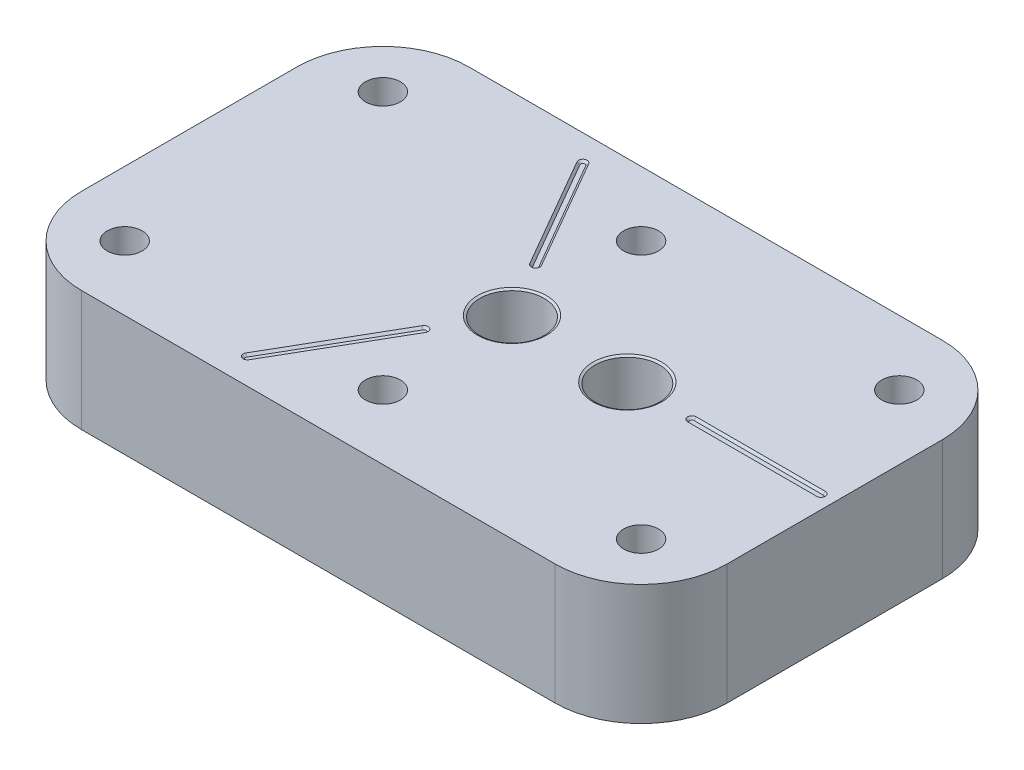
ISO-10303-21;
HEADER;
FILE_DESCRIPTION(('STEP AP214'),'2;1');
FILE_NAME('part.step','',(''),(''),'','','');
FILE_SCHEMA(('AUTOMOTIVE_DESIGN { 1 0 10303 214 1 1 1 1 }'));
ENDSEC;
DATA;
#1=APPLICATION_CONTEXT('core data for automotive mechanical design processes');
#2=APPLICATION_PROTOCOL_DEFINITION('international standard','automotive_design',2000,#1);
#3=PRODUCT_CONTEXT('',#1,'mechanical');
#4=PRODUCT('Part','Part','',(#3));
#5=PRODUCT_RELATED_PRODUCT_CATEGORY('part','',(#4));
#6=PRODUCT_DEFINITION_FORMATION('','',#4);
#7=PRODUCT_DEFINITION_CONTEXT('part definition',#1,'design');
#8=PRODUCT_DEFINITION('design','',#6,#7);
#9=PRODUCT_DEFINITION_SHAPE('','',#8);
#10=(LENGTH_UNIT() NAMED_UNIT(*) SI_UNIT(.MILLI.,.METRE.));
#11=(NAMED_UNIT(*) PLANE_ANGLE_UNIT() SI_UNIT($,.RADIAN.));
#12=(NAMED_UNIT(*) SI_UNIT($,.STERADIAN.) SOLID_ANGLE_UNIT());
#13=UNCERTAINTY_MEASURE_WITH_UNIT(LENGTH_MEASURE(1.E-05),#10,'distance_accuracy_value','');
#14=(GEOMETRIC_REPRESENTATION_CONTEXT(3) GLOBAL_UNCERTAINTY_ASSIGNED_CONTEXT((#13)) GLOBAL_UNIT_ASSIGNED_CONTEXT((#10,
#11,#12)) REPRESENTATION_CONTEXT('',''));
#15=CARTESIAN_POINT('',(0.,0.,0.));
#16=DIRECTION('',(0.,0.,1.));
#17=DIRECTION('',(1.,0.,0.));
#18=AXIS2_PLACEMENT_3D('',#15,#16,#17);
#19=CARTESIAN_POINT('',(95.25,35.56,-57.15));
#20=DIRECTION('',(-1.,0.,0.));
#21=DIRECTION('',(0.,0.,1.));
#22=AXIS2_PLACEMENT_3D('',#19,#20,#21);
#23=PLANE('',#22);
#24=DIRECTION('',(0.,0.,-1.));
#25=VECTOR('',#24,1.);
#26=CARTESIAN_POINT('',(95.25,0.,-57.15));
#27=LINE('',#26,#25);
#28=CARTESIAN_POINT('',(95.25,0.,31.75));
#29=VERTEX_POINT('',#28);
#30=CARTESIAN_POINT('',(95.25,0.,-31.75));
#31=VERTEX_POINT('',#30);
#32=EDGE_CURVE('E285',#29,#31,#27,.T.);
#33=ORIENTED_EDGE('',*,*,#32,.T.);
#34=DIRECTION('',(0.,-1.,0.));
#35=VECTOR('',#34,1.);
#36=CARTESIAN_POINT('',(95.25,35.56,-31.75));
#37=LINE('',#36,#35);
#38=CARTESIAN_POINT('',(95.25,35.56,-31.75));
#39=VERTEX_POINT('',#38);
#40=EDGE_CURVE('E349',#31,#39,#37,.F.);
#41=ORIENTED_EDGE('',*,*,#40,.T.);
#42=DIRECTION('',(0.,0.,-1.));
#43=VECTOR('',#42,1.);
#44=CARTESIAN_POINT('',(95.25,35.56,-57.15));
#45=LINE('',#44,#43);
#46=CARTESIAN_POINT('',(95.25,35.56,31.75));
#47=VERTEX_POINT('',#46);
#48=EDGE_CURVE('E286',#47,#39,#45,.T.);
#49=ORIENTED_EDGE('',*,*,#48,.F.);
#50=DIRECTION('',(0.,-1.,0.));
#51=VECTOR('',#50,1.);
#52=CARTESIAN_POINT('',(95.25,35.56,31.75));
#53=LINE('',#52,#51);
#54=EDGE_CURVE('E346',#47,#29,#53,.T.);
#55=ORIENTED_EDGE('',*,*,#54,.T.);
#56=EDGE_LOOP('',(#33,#41,#49,#55));
#57=FACE_BOUND('',#56,.T.);
#58=ADVANCED_FACE('F33',(#57),#23,.F.);
#59=CARTESIAN_POINT('',(-95.25,35.56,-57.15));
#60=DIRECTION('',(0.,0.,1.));
#61=DIRECTION('',(1.,0.,0.));
#62=AXIS2_PLACEMENT_3D('',#59,#60,#61);
#63=PLANE('',#62);
#64=DIRECTION('',(-1.,0.,0.));
#65=VECTOR('',#64,1.);
#66=CARTESIAN_POINT('',(-95.25,35.56,-57.15));
#67=LINE('',#66,#65);
#68=CARTESIAN_POINT('',(69.85,35.56,-57.15));
#69=VERTEX_POINT('',#68);
#70=CARTESIAN_POINT('',(-69.85,35.56,-57.15));
#71=VERTEX_POINT('',#70);
#72=EDGE_CURVE('E289',#69,#71,#67,.T.);
#73=ORIENTED_EDGE('',*,*,#72,.F.);
#74=DIRECTION('',(0.,-1.,0.));
#75=VECTOR('',#74,1.);
#76=CARTESIAN_POINT('',(69.85,35.56,-57.15));
#77=LINE('',#76,#75);
#78=CARTESIAN_POINT('',(69.85,0.,-57.15));
#79=VERTEX_POINT('',#78);
#80=EDGE_CURVE('E335',#69,#79,#77,.T.);
#81=ORIENTED_EDGE('',*,*,#80,.T.);
#82=DIRECTION('',(-1.,0.,0.));
#83=VECTOR('',#82,1.);
#84=CARTESIAN_POINT('',(-95.25,0.,-57.15));
#85=LINE('',#84,#83);
#86=CARTESIAN_POINT('',(-69.85,0.,-57.15));
#87=VERTEX_POINT('',#86);
#88=EDGE_CURVE('E302',#79,#87,#85,.T.);
#89=ORIENTED_EDGE('',*,*,#88,.T.);
#90=DIRECTION('',(0.,-1.,0.));
#91=VECTOR('',#90,1.);
#92=CARTESIAN_POINT('',(-69.85,35.56,-57.15));
#93=LINE('',#92,#91);
#94=EDGE_CURVE('E333',#87,#71,#93,.F.);
#95=ORIENTED_EDGE('',*,*,#94,.T.);
#96=EDGE_LOOP('',(#73,#81,#89,#95));
#97=FACE_BOUND('',#96,.T.);
#98=ADVANCED_FACE('F424',(#97),#63,.F.);
#99=CARTESIAN_POINT('',(-95.25,35.56,-57.15));
#100=DIRECTION('',(1.,0.,0.));
#101=DIRECTION('',(0.,0.,-1.));
#102=AXIS2_PLACEMENT_3D('',#99,#100,#101);
#103=PLANE('',#102);
#104=DIRECTION('',(0.,0.,1.));
#105=VECTOR('',#104,1.);
#106=CARTESIAN_POINT('',(-95.25,0.,-57.15));
#107=LINE('',#106,#105);
#108=CARTESIAN_POINT('',(-95.25,0.,-31.75));
#109=VERTEX_POINT('',#108);
#110=CARTESIAN_POINT('',(-95.25,0.,31.75));
#111=VERTEX_POINT('',#110);
#112=EDGE_CURVE('E305',#109,#111,#107,.T.);
#113=ORIENTED_EDGE('',*,*,#112,.T.);
#114=DIRECTION('',(0.,-1.,0.));
#115=VECTOR('',#114,1.);
#116=CARTESIAN_POINT('',(-95.25,35.56,31.75));
#117=LINE('',#116,#115);
#118=CARTESIAN_POINT('',(-95.25,35.56,31.75));
#119=VERTEX_POINT('',#118);
#120=EDGE_CURVE('E11',#111,#119,#117,.F.);
#121=ORIENTED_EDGE('',*,*,#120,.T.);
#122=DIRECTION('',(0.,0.,1.));
#123=VECTOR('',#122,1.);
#124=CARTESIAN_POINT('',(-95.25,35.56,-57.15));
#125=LINE('',#124,#123);
#126=CARTESIAN_POINT('',(-95.25,35.56,-31.75));
#127=VERTEX_POINT('',#126);
#128=EDGE_CURVE('E293',#127,#119,#125,.T.);
#129=ORIENTED_EDGE('',*,*,#128,.F.);
#130=DIRECTION('',(0.,-1.,0.));
#131=VECTOR('',#130,1.);
#132=CARTESIAN_POINT('',(-95.25,35.56,-31.75));
#133=LINE('',#132,#131);
#134=EDGE_CURVE('E42',#127,#109,#133,.T.);
#135=ORIENTED_EDGE('',*,*,#134,.T.);
#136=EDGE_LOOP('',(#113,#121,#129,#135));
#137=FACE_BOUND('',#136,.T.);
#138=ADVANCED_FACE('F430',(#137),#103,.F.);
#139=CARTESIAN_POINT('',(-95.25,35.56,57.15));
#140=DIRECTION('',(0.,0.,-1.));
#141=DIRECTION('',(-1.,0.,0.));
#142=AXIS2_PLACEMENT_3D('',#139,#140,#141);
#143=PLANE('',#142);
#144=DIRECTION('',(1.,0.,0.));
#145=VECTOR('',#144,1.);
#146=CARTESIAN_POINT('',(-95.25,0.,57.15));
#147=LINE('',#146,#145);
#148=CARTESIAN_POINT('',(-69.85,0.,57.15));
#149=VERTEX_POINT('',#148);
#150=CARTESIAN_POINT('',(69.85,0.,57.15));
#151=VERTEX_POINT('',#150);
#152=EDGE_CURVE('E290',#149,#151,#147,.T.);
#153=ORIENTED_EDGE('',*,*,#152,.T.);
#154=DIRECTION('',(0.,-1.,0.));
#155=VECTOR('',#154,1.);
#156=CARTESIAN_POINT('',(69.85,35.56,57.15));
#157=LINE('',#156,#155);
#158=CARTESIAN_POINT('',(69.85,35.56,57.15));
#159=VERTEX_POINT('',#158);
#160=EDGE_CURVE('E362',#151,#159,#157,.F.);
#161=ORIENTED_EDGE('',*,*,#160,.T.);
#162=DIRECTION('',(1.,0.,0.));
#163=VECTOR('',#162,1.);
#164=CARTESIAN_POINT('',(-95.25,35.56,57.15));
#165=LINE('',#164,#163);
#166=CARTESIAN_POINT('',(-69.85,35.56,57.15));
#167=VERTEX_POINT('',#166);
#168=EDGE_CURVE('E296',#167,#159,#165,.T.);
#169=ORIENTED_EDGE('',*,*,#168,.F.);
#170=DIRECTION('',(0.,-1.,0.));
#171=VECTOR('',#170,1.);
#172=CARTESIAN_POINT('',(-69.85,35.56,57.15));
#173=LINE('',#172,#171);
#174=EDGE_CURVE('E359',#167,#149,#173,.T.);
#175=ORIENTED_EDGE('',*,*,#174,.T.);
#176=EDGE_LOOP('',(#153,#161,#169,#175));
#177=FACE_BOUND('',#176,.T.);
#178=ADVANCED_FACE('F402',(#177),#143,.F.);
#179=CARTESIAN_POINT('',(95.25,35.56,57.15));
#180=DIRECTION('',(0.,1.,0.));
#181=DIRECTION('',(0.,0.,1.));
#182=AXIS2_PLACEMENT_3D('',#179,#180,#181);
#183=PLANE('',#182);
#184=CARTESIAN_POINT('',(0.,35.56,0.));
#185=DIRECTION('',(0.,1.,0.));
#186=DIRECTION('',(0.,0.,1.));
#187=AXIS2_PLACEMENT_3D('',#184,#185,#186);
#188=CIRCLE('',#187,10.16);
#189=CARTESIAN_POINT('',(0.,35.56,10.16));
#190=VERTEX_POINT('',#189);
#191=EDGE_CURVE('E393',#190,#190,#188,.T.);
#192=ORIENTED_EDGE('',*,*,#191,.F.);
#193=EDGE_LOOP('',(#192));
#194=FACE_BOUND('',#193,.T.);
#195=CARTESIAN_POINT('',(34.036,35.56,0.));
#196=DIRECTION('',(0.,1.,0.));
#197=DIRECTION('',(0.,0.,1.));
#198=AXIS2_PLACEMENT_3D('',#195,#196,#197);
#199=CIRCLE('',#198,10.16);
#200=CARTESIAN_POINT('',(34.036,35.56,10.16));
#201=VERTEX_POINT('',#200);
#202=EDGE_CURVE('E381',#201,#201,#199,.T.);
#203=ORIENTED_EDGE('',*,*,#202,.F.);
#204=EDGE_LOOP('',(#203));
#205=FACE_BOUND('',#204,.T.);
#206=CARTESIAN_POINT('',(53.086,35.56,0.));
#207=DIRECTION('',(0.,1.,0.));
#208=DIRECTION('',(0.,0.,-1.));
#209=AXIS2_PLACEMENT_3D('',#206,#207,#208);
#210=CIRCLE('',#209,1.27);
#211=CARTESIAN_POINT('',(53.086,35.56,-1.27));
#212=VERTEX_POINT('',#211);
#213=CARTESIAN_POINT('',(53.086,35.56,1.26999999999999));
#214=VERTEX_POINT('',#213);
#215=EDGE_CURVE('E50',#212,#214,#210,.T.);
#216=ORIENTED_EDGE('',*,*,#215,.F.);
#217=DIRECTION('',(-1.,0.,0.));
#218=VECTOR('',#217,1.);
#219=CARTESIAN_POINT('',(53.086,35.56,-1.27));
#220=LINE('',#219,#218);
#221=CARTESIAN_POINT('',(91.186,35.56,-1.27));
#222=VERTEX_POINT('',#221);
#223=EDGE_CURVE('E193',#222,#212,#220,.T.);
#224=ORIENTED_EDGE('',*,*,#223,.F.);
#225=CARTESIAN_POINT('',(91.186,35.56,0.));
#226=DIRECTION('',(0.,1.,0.));
#227=DIRECTION('',(0.,0.,1.));
#228=AXIS2_PLACEMENT_3D('',#225,#226,#227);
#229=CIRCLE('',#228,1.27);
#230=CARTESIAN_POINT('',(91.186,35.56,1.27));
#231=VERTEX_POINT('',#230);
#232=EDGE_CURVE('E175',#231,#222,#229,.T.);
#233=ORIENTED_EDGE('',*,*,#232,.F.);
#234=DIRECTION('',(1.,0.,0.));
#235=VECTOR('',#234,1.);
#236=CARTESIAN_POINT('',(53.086,35.56,1.27));
#237=LINE('',#236,#235);
#238=EDGE_CURVE('E186',#214,#231,#237,.T.);
#239=ORIENTED_EDGE('',*,*,#238,.F.);
#240=EDGE_LOOP('',(#216,#224,#233,#239));
#241=FACE_BOUND('',#240,.T.);
#242=CARTESIAN_POINT('',(-9.52499999999995,35.56,16.4977839420936));
#243=DIRECTION('',(0.,1.,0.));
#244=DIRECTION('',(0.,0.,-1.));
#245=AXIS2_PLACEMENT_3D('',#242,#243,#244);
#246=CIRCLE('',#245,1.27);
#247=CARTESIAN_POINT('',(-8.42514773719371,35.56,17.1327839420936));
#248=VERTEX_POINT('',#247);
#249=CARTESIAN_POINT('',(-10.6248522628062,35.56,15.8627839420936));
#250=VERTEX_POINT('',#249);
#251=EDGE_CURVE('E58',#248,#250,#246,.T.);
#252=ORIENTED_EDGE('',*,*,#251,.F.);
#253=DIRECTION('',(0.499999999999998,0.,-0.86602540378444));
#254=VECTOR('',#253,1.);
#255=CARTESIAN_POINT('',(-8.42514773719371,35.56,17.1327839420936));
#256=LINE('',#255,#254);
#257=CARTESIAN_POINT('',(-27.4751477371936,35.56,50.1283518262807));
#258=VERTEX_POINT('',#257);
#259=EDGE_CURVE('E218',#258,#248,#256,.T.);
#260=ORIENTED_EDGE('',*,*,#259,.F.);
#261=CARTESIAN_POINT('',(-28.5749999999999,35.56,49.4933518262807));
#262=DIRECTION('',(0.,1.,0.));
#263=DIRECTION('',(0.,0.,1.));
#264=AXIS2_PLACEMENT_3D('',#261,#262,#263);
#265=CIRCLE('',#264,1.27);
#266=CARTESIAN_POINT('',(-29.6748522628061,35.56,48.8583518262807));
#267=VERTEX_POINT('',#266);
#268=EDGE_CURVE('E215',#267,#258,#265,.T.);
#269=ORIENTED_EDGE('',*,*,#268,.F.);
#270=DIRECTION('',(-0.499999999999998,0.,0.86602540378444));
#271=VECTOR('',#270,1.);
#272=CARTESIAN_POINT('',(-10.6248522628062,35.56,15.8627839420936));
#273=LINE('',#272,#271);
#274=EDGE_CURVE('E212',#250,#267,#273,.T.);
#275=ORIENTED_EDGE('',*,*,#274,.F.);
#276=EDGE_LOOP('',(#252,#260,#269,#275));
#277=FACE_BOUND('',#276,.T.);
#278=CARTESIAN_POINT('',(-9.52500000000008,35.56,-16.4977839420935));
#279=DIRECTION('',(0.,1.,0.));
#280=DIRECTION('',(0.,0.,-1.));
#281=AXIS2_PLACEMENT_3D('',#278,#279,#280);
#282=CIRCLE('',#281,1.27);
#283=CARTESIAN_POINT('',(-10.6248522628063,35.56,-15.8627839420935));
#284=VERTEX_POINT('',#283);
#285=CARTESIAN_POINT('',(-8.42514773719385,35.56,-17.1327839420935));
#286=VERTEX_POINT('',#285);
#287=EDGE_CURVE('E224',#284,#286,#282,.T.);
#288=ORIENTED_EDGE('',*,*,#287,.F.);
#289=DIRECTION('',(0.500000000000004,0.,0.866025403784436));
#290=VECTOR('',#289,1.);
#291=CARTESIAN_POINT('',(-10.6248522628063,35.56,-15.8627839420935));
#292=LINE('',#291,#290);
#293=CARTESIAN_POINT('',(-29.6748522628065,35.56,-48.8583518262805));
#294=VERTEX_POINT('',#293);
#295=EDGE_CURVE('E249',#294,#284,#292,.T.);
#296=ORIENTED_EDGE('',*,*,#295,.F.);
#297=CARTESIAN_POINT('',(-28.5750000000002,35.56,-49.4933518262805));
#298=DIRECTION('',(0.,1.,0.));
#299=DIRECTION('',(0.,0.,1.));
#300=AXIS2_PLACEMENT_3D('',#297,#298,#299);
#301=CIRCLE('',#300,1.27);
#302=CARTESIAN_POINT('',(-27.475147737194,35.56,-50.1283518262805));
#303=VERTEX_POINT('',#302);
#304=EDGE_CURVE('E246',#303,#294,#301,.T.);
#305=ORIENTED_EDGE('',*,*,#304,.F.);
#306=DIRECTION('',(-0.500000000000004,0.,-0.866025403784436));
#307=VECTOR('',#306,1.);
#308=CARTESIAN_POINT('',(-8.42514773719385,35.56,-17.1327839420935));
#309=LINE('',#308,#307);
#310=EDGE_CURVE('E243',#286,#303,#309,.T.);
#311=ORIENTED_EDGE('',*,*,#310,.F.);
#312=EDGE_LOOP('',(#288,#296,#305,#311));
#313=FACE_BOUND('',#312,.T.);
#314=CARTESIAN_POINT('',(0.,35.56,-38.1));
#315=DIRECTION('',(0.,1.,0.));
#316=DIRECTION('',(0.,0.,1.));
#317=AXIS2_PLACEMENT_3D('',#314,#315,#316);
#318=CIRCLE('',#317,5.15873999999999);
#319=CARTESIAN_POINT('',(0.,35.56,-32.94126));
#320=VERTEX_POINT('',#319);
#321=EDGE_CURVE('E276',#320,#320,#318,.T.);
#322=ORIENTED_EDGE('',*,*,#321,.F.);
#323=EDGE_LOOP('',(#322));
#324=FACE_BOUND('',#323,.T.);
#325=CARTESIAN_POINT('',(-76.2,35.56,-38.1));
#326=DIRECTION('',(0.,1.,0.));
#327=DIRECTION('',(0.,0.,1.));
#328=AXIS2_PLACEMENT_3D('',#325,#326,#327);
#329=CIRCLE('',#328,5.15873999999999);
#330=CARTESIAN_POINT('',(-76.2,35.56,-32.94126));
#331=VERTEX_POINT('',#330);
#332=EDGE_CURVE('E279',#331,#331,#329,.T.);
#333=ORIENTED_EDGE('',*,*,#332,.F.);
#334=EDGE_LOOP('',(#333));
#335=FACE_BOUND('',#334,.T.);
#336=ORIENTED_EDGE('',*,*,#48,.T.);
#337=CARTESIAN_POINT('',(69.85,35.56,-31.75));
#338=DIRECTION('',(0.,1.,0.));
#339=DIRECTION('',(0.,0.,1.));
#340=AXIS2_PLACEMENT_3D('',#337,#338,#339);
#341=CIRCLE('',#340,25.4);
#342=EDGE_CURVE('E357',#39,#69,#341,.T.);
#343=ORIENTED_EDGE('',*,*,#342,.T.);
#344=ORIENTED_EDGE('',*,*,#72,.T.);
#345=CARTESIAN_POINT('',(-69.85,35.56,-31.75));
#346=DIRECTION('',(0.,1.,0.));
#347=DIRECTION('',(0.,0.,1.));
#348=AXIS2_PLACEMENT_3D('',#345,#346,#347);
#349=CIRCLE('',#348,25.4);
#350=EDGE_CURVE('E351',#71,#127,#349,.T.);
#351=ORIENTED_EDGE('',*,*,#350,.T.);
#352=ORIENTED_EDGE('',*,*,#128,.T.);
#353=CARTESIAN_POINT('',(-69.85,35.56,31.75));
#354=DIRECTION('',(0.,1.,0.));
#355=DIRECTION('',(0.,0.,1.));
#356=AXIS2_PLACEMENT_3D('',#353,#354,#355);
#357=CIRCLE('',#356,25.4);
#358=EDGE_CURVE('E353',#119,#167,#357,.T.);
#359=ORIENTED_EDGE('',*,*,#358,.T.);
#360=ORIENTED_EDGE('',*,*,#168,.T.);
#361=CARTESIAN_POINT('',(69.85,35.56,31.75));
#362=DIRECTION('',(0.,1.,0.));
#363=DIRECTION('',(0.,0.,1.));
#364=AXIS2_PLACEMENT_3D('',#361,#362,#363);
#365=CIRCLE('',#364,25.4);
#366=EDGE_CURVE('E355',#159,#47,#365,.T.);
#367=ORIENTED_EDGE('',*,*,#366,.T.);
#368=EDGE_LOOP('',(#336,#343,#344,#351,#352,#359,#360,#367));
#369=FACE_BOUND('',#368,.T.);
#370=CARTESIAN_POINT('',(76.2,35.56,-38.1));
#371=DIRECTION('',(0.,1.,0.));
#372=DIRECTION('',(0.,0.,1.));
#373=AXIS2_PLACEMENT_3D('',#370,#371,#372);
#374=CIRCLE('',#373,5.15873999999999);
#375=CARTESIAN_POINT('',(76.2,35.56,-32.94126));
#376=VERTEX_POINT('',#375);
#377=EDGE_CURVE('E312',#376,#376,#374,.T.);
#378=ORIENTED_EDGE('',*,*,#377,.F.);
#379=EDGE_LOOP('',(#378));
#380=FACE_BOUND('',#379,.T.);
#381=CARTESIAN_POINT('',(-76.2,35.56,38.1));
#382=DIRECTION('',(0.,1.,0.));
#383=DIRECTION('',(0.,0.,1.));
#384=AXIS2_PLACEMENT_3D('',#381,#382,#383);
#385=CIRCLE('',#384,5.15873999999999);
#386=CARTESIAN_POINT('',(-76.2,35.56,43.25874));
#387=VERTEX_POINT('',#386);
#388=EDGE_CURVE('E318',#387,#387,#385,.T.);
#389=ORIENTED_EDGE('',*,*,#388,.F.);
#390=EDGE_LOOP('',(#389));
#391=FACE_BOUND('',#390,.T.);
#392=CARTESIAN_POINT('',(0.,35.56,38.1));
#393=DIRECTION('',(0.,1.,0.));
#394=DIRECTION('',(0.,0.,1.));
#395=AXIS2_PLACEMENT_3D('',#392,#393,#394);
#396=CIRCLE('',#395,5.15873999999999);
#397=CARTESIAN_POINT('',(0.,35.56,43.25874));
#398=VERTEX_POINT('',#397);
#399=EDGE_CURVE('E324',#398,#398,#396,.T.);
#400=ORIENTED_EDGE('',*,*,#399,.F.);
#401=EDGE_LOOP('',(#400));
#402=FACE_BOUND('',#401,.T.);
#403=CARTESIAN_POINT('',(76.2,35.56,38.1));
#404=DIRECTION('',(0.,1.,0.));
#405=DIRECTION('',(0.,0.,1.));
#406=AXIS2_PLACEMENT_3D('',#403,#404,#405);
#407=CIRCLE('',#406,5.15873999999999);
#408=CARTESIAN_POINT('',(76.2,35.56,43.25874));
#409=VERTEX_POINT('',#408);
#410=EDGE_CURVE('E330',#409,#409,#407,.T.);
#411=ORIENTED_EDGE('',*,*,#410,.F.);
#412=EDGE_LOOP('',(#411));
#413=FACE_BOUND('',#412,.T.);
#414=ADVANCED_FACE('F190',(#194,#205,#241,#277,#313,#324,#335,#369,#380,#391,#402,#413),#183,.T.);
#415=CARTESIAN_POINT('',(95.25,0.,57.15));
#416=DIRECTION('',(0.,1.,0.));
#417=DIRECTION('',(0.,0.,1.));
#418=AXIS2_PLACEMENT_3D('',#415,#416,#417);
#419=PLANE('',#418);
#420=CARTESIAN_POINT('',(0.,0.,0.));
#421=DIRECTION('',(0.,1.,0.));
#422=DIRECTION('',(0.,0.,1.));
#423=AXIS2_PLACEMENT_3D('',#420,#421,#422);
#424=CIRCLE('',#423,8.33373999999999);
#425=CARTESIAN_POINT('',(0.,0.,8.33373999999999));
#426=VERTEX_POINT('',#425);
#427=EDGE_CURVE('E37',#426,#426,#424,.T.);
#428=ORIENTED_EDGE('',*,*,#427,.T.);
#429=EDGE_LOOP('',(#428));
#430=FACE_BOUND('',#429,.T.);
#431=CARTESIAN_POINT('',(34.036,0.,0.));
#432=DIRECTION('',(0.,1.,0.));
#433=DIRECTION('',(0.,0.,1.));
#434=AXIS2_PLACEMENT_3D('',#431,#432,#433);
#435=CIRCLE('',#434,8.33373999999999);
#436=CARTESIAN_POINT('',(34.036,0.,8.33373999999999));
#437=VERTEX_POINT('',#436);
#438=EDGE_CURVE('E365',#437,#437,#435,.T.);
#439=ORIENTED_EDGE('',*,*,#438,.T.);
#440=EDGE_LOOP('',(#439));
#441=FACE_BOUND('',#440,.T.);
#442=CARTESIAN_POINT('',(0.,0.,-38.1));
#443=DIRECTION('',(0.,1.,0.));
#444=DIRECTION('',(0.,0.,1.));
#445=AXIS2_PLACEMENT_3D('',#442,#443,#444);
#446=CIRCLE('',#445,5.15873999999999);
#447=CARTESIAN_POINT('',(0.,0.,-32.94126));
#448=VERTEX_POINT('',#447);
#449=EDGE_CURVE('E255',#448,#448,#446,.T.);
#450=ORIENTED_EDGE('',*,*,#449,.T.);
#451=EDGE_LOOP('',(#450));
#452=FACE_BOUND('',#451,.T.);
#453=CARTESIAN_POINT('',(-76.2,0.,-38.1));
#454=DIRECTION('',(0.,1.,0.));
#455=DIRECTION('',(0.,0.,1.));
#456=AXIS2_PLACEMENT_3D('',#453,#454,#455);
#457=CIRCLE('',#456,5.15873999999999);
#458=CARTESIAN_POINT('',(-76.2,0.,-32.94126));
#459=VERTEX_POINT('',#458);
#460=EDGE_CURVE('E282',#459,#459,#457,.T.);
#461=ORIENTED_EDGE('',*,*,#460,.T.);
#462=EDGE_LOOP('',(#461));
#463=FACE_BOUND('',#462,.T.);
#464=ORIENTED_EDGE('',*,*,#88,.F.);
#465=CARTESIAN_POINT('',(69.85,0.,-31.75));
#466=DIRECTION('',(0.,1.,0.));
#467=DIRECTION('',(0.,0.,1.));
#468=AXIS2_PLACEMENT_3D('',#465,#466,#467);
#469=CIRCLE('',#468,25.4);
#470=EDGE_CURVE('E344',#79,#31,#469,.F.);
#471=ORIENTED_EDGE('',*,*,#470,.T.);
#472=ORIENTED_EDGE('',*,*,#32,.F.);
#473=CARTESIAN_POINT('',(69.85,0.,31.75));
#474=DIRECTION('',(0.,1.,0.));
#475=DIRECTION('',(0.,0.,1.));
#476=AXIS2_PLACEMENT_3D('',#473,#474,#475);
#477=CIRCLE('',#476,25.4);
#478=EDGE_CURVE('E342',#29,#151,#477,.F.);
#479=ORIENTED_EDGE('',*,*,#478,.T.);
#480=ORIENTED_EDGE('',*,*,#152,.F.);
#481=CARTESIAN_POINT('',(-69.85,0.,31.75));
#482=DIRECTION('',(0.,1.,0.));
#483=DIRECTION('',(0.,0.,1.));
#484=AXIS2_PLACEMENT_3D('',#481,#482,#483);
#485=CIRCLE('',#484,25.4);
#486=EDGE_CURVE('E340',#149,#111,#485,.F.);
#487=ORIENTED_EDGE('',*,*,#486,.T.);
#488=ORIENTED_EDGE('',*,*,#112,.F.);
#489=CARTESIAN_POINT('',(-69.85,0.,-31.75));
#490=DIRECTION('',(0.,1.,0.));
#491=DIRECTION('',(0.,0.,1.));
#492=AXIS2_PLACEMENT_3D('',#489,#490,#491);
#493=CIRCLE('',#492,25.4);
#494=EDGE_CURVE('E338',#109,#87,#493,.F.);
#495=ORIENTED_EDGE('',*,*,#494,.T.);
#496=EDGE_LOOP('',(#464,#471,#472,#479,#480,#487,#488,#495));
#497=FACE_BOUND('',#496,.T.);
#498=CARTESIAN_POINT('',(76.2,0.,-38.1));
#499=DIRECTION('',(0.,1.,0.));
#500=DIRECTION('',(0.,0.,1.));
#501=AXIS2_PLACEMENT_3D('',#498,#499,#500);
#502=CIRCLE('',#501,5.15873999999999);
#503=CARTESIAN_POINT('',(76.2,0.,-32.94126));
#504=VERTEX_POINT('',#503);
#505=EDGE_CURVE('E299',#504,#504,#502,.T.);
#506=ORIENTED_EDGE('',*,*,#505,.T.);
#507=EDGE_LOOP('',(#506));
#508=FACE_BOUND('',#507,.T.);
#509=CARTESIAN_POINT('',(-76.2,0.,38.1));
#510=DIRECTION('',(0.,1.,0.));
#511=DIRECTION('',(0.,0.,1.));
#512=AXIS2_PLACEMENT_3D('',#509,#510,#511);
#513=CIRCLE('',#512,5.15873999999999);
#514=CARTESIAN_POINT('',(-76.2,0.,43.25874));
#515=VERTEX_POINT('',#514);
#516=EDGE_CURVE('E315',#515,#515,#513,.T.);
#517=ORIENTED_EDGE('',*,*,#516,.T.);
#518=EDGE_LOOP('',(#517));
#519=FACE_BOUND('',#518,.T.);
#520=CARTESIAN_POINT('',(0.,0.,38.1));
#521=DIRECTION('',(0.,1.,0.));
#522=DIRECTION('',(0.,0.,1.));
#523=AXIS2_PLACEMENT_3D('',#520,#521,#522);
#524=CIRCLE('',#523,5.15873999999999);
#525=CARTESIAN_POINT('',(0.,0.,43.25874));
#526=VERTEX_POINT('',#525);
#527=EDGE_CURVE('E321',#526,#526,#524,.T.);
#528=ORIENTED_EDGE('',*,*,#527,.T.);
#529=EDGE_LOOP('',(#528));
#530=FACE_BOUND('',#529,.T.);
#531=CARTESIAN_POINT('',(76.2,0.,38.1));
#532=DIRECTION('',(0.,1.,0.));
#533=DIRECTION('',(0.,0.,1.));
#534=AXIS2_PLACEMENT_3D('',#531,#532,#533);
#535=CIRCLE('',#534,5.15873999999999);
#536=CARTESIAN_POINT('',(76.2,0.,43.25874));
#537=VERTEX_POINT('',#536);
#538=EDGE_CURVE('E327',#537,#537,#535,.T.);
#539=ORIENTED_EDGE('',*,*,#538,.T.);
#540=EDGE_LOOP('',(#539));
#541=FACE_BOUND('',#540,.T.);
#542=ADVANCED_FACE('F401',(#430,#441,#452,#463,#497,#508,#519,#530,#541),#419,.F.);
#543=CARTESIAN_POINT('',(-76.2,35.56,-38.1));
#544=DIRECTION('',(0.,1.,0.));
#545=DIRECTION('',(0.,0.,1.));
#546=AXIS2_PLACEMENT_3D('',#543,#544,#545);
#547=CYLINDRICAL_SURFACE('',#546,5.15873999999999);
#548=ORIENTED_EDGE('',*,*,#460,.F.);
#549=EDGE_LOOP('',(#548));
#550=FACE_BOUND('',#549,.T.);
#551=ORIENTED_EDGE('',*,*,#332,.T.);
#552=EDGE_LOOP('',(#551));
#553=FACE_BOUND('',#552,.T.);
#554=ADVANCED_FACE('F494',(#550,#553),#547,.F.);
#555=CARTESIAN_POINT('',(0.,35.56,-38.1));
#556=DIRECTION('',(0.,1.,0.));
#557=DIRECTION('',(0.,0.,1.));
#558=AXIS2_PLACEMENT_3D('',#555,#556,#557);
#559=CYLINDRICAL_SURFACE('',#558,5.15873999999999);
#560=ORIENTED_EDGE('',*,*,#449,.F.);
#561=EDGE_LOOP('',(#560));
#562=FACE_BOUND('',#561,.T.);
#563=ORIENTED_EDGE('',*,*,#321,.T.);
#564=EDGE_LOOP('',(#563));
#565=FACE_BOUND('',#564,.T.);
#566=ADVANCED_FACE('F439',(#562,#565),#559,.F.);
#567=CARTESIAN_POINT('',(76.2,35.56,-38.1));
#568=DIRECTION('',(0.,1.,0.));
#569=DIRECTION('',(0.,0.,1.));
#570=AXIS2_PLACEMENT_3D('',#567,#568,#569);
#571=CYLINDRICAL_SURFACE('',#570,5.15873999999999);
#572=ORIENTED_EDGE('',*,*,#505,.F.);
#573=EDGE_LOOP('',(#572));
#574=FACE_BOUND('',#573,.T.);
#575=ORIENTED_EDGE('',*,*,#377,.T.);
#576=EDGE_LOOP('',(#575));
#577=FACE_BOUND('',#576,.T.);
#578=ADVANCED_FACE('F435',(#574,#577),#571,.F.);
#579=CARTESIAN_POINT('',(-76.2,35.56,38.1));
#580=DIRECTION('',(0.,1.,0.));
#581=DIRECTION('',(0.,0.,1.));
#582=AXIS2_PLACEMENT_3D('',#579,#580,#581);
#583=CYLINDRICAL_SURFACE('',#582,5.15873999999999);
#584=ORIENTED_EDGE('',*,*,#516,.F.);
#585=EDGE_LOOP('',(#584));
#586=FACE_BOUND('',#585,.T.);
#587=ORIENTED_EDGE('',*,*,#388,.T.);
#588=EDGE_LOOP('',(#587));
#589=FACE_BOUND('',#588,.T.);
#590=ADVANCED_FACE('F438',(#586,#589),#583,.F.);
#591=CARTESIAN_POINT('',(0.,35.56,38.1));
#592=DIRECTION('',(0.,1.,0.));
#593=DIRECTION('',(0.,0.,1.));
#594=AXIS2_PLACEMENT_3D('',#591,#592,#593);
#595=CYLINDRICAL_SURFACE('',#594,5.15873999999999);
#596=ORIENTED_EDGE('',*,*,#527,.F.);
#597=EDGE_LOOP('',(#596));
#598=FACE_BOUND('',#597,.T.);
#599=ORIENTED_EDGE('',*,*,#399,.T.);
#600=EDGE_LOOP('',(#599));
#601=FACE_BOUND('',#600,.T.);
#602=ADVANCED_FACE('F443',(#598,#601),#595,.F.);
#603=CARTESIAN_POINT('',(76.2,35.56,38.1));
#604=DIRECTION('',(0.,1.,0.));
#605=DIRECTION('',(0.,0.,1.));
#606=AXIS2_PLACEMENT_3D('',#603,#604,#605);
#607=CYLINDRICAL_SURFACE('',#606,5.15873999999999);
#608=ORIENTED_EDGE('',*,*,#538,.F.);
#609=EDGE_LOOP('',(#608));
#610=FACE_BOUND('',#609,.T.);
#611=ORIENTED_EDGE('',*,*,#410,.T.);
#612=EDGE_LOOP('',(#611));
#613=FACE_BOUND('',#612,.T.);
#614=ADVANCED_FACE('F447',(#610,#613),#607,.F.);
#615=CARTESIAN_POINT('',(69.85,35.56,-31.75));
#616=DIRECTION('',(0.,-1.,0.));
#617=DIRECTION('',(0.,0.,-1.));
#618=AXIS2_PLACEMENT_3D('',#615,#616,#617);
#619=CYLINDRICAL_SURFACE('',#618,25.4);
#620=ORIENTED_EDGE('',*,*,#342,.F.);
#621=ORIENTED_EDGE('',*,*,#40,.F.);
#622=ORIENTED_EDGE('',*,*,#470,.F.);
#623=ORIENTED_EDGE('',*,*,#80,.F.);
#624=EDGE_LOOP('',(#620,#621,#622,#623));
#625=FACE_BOUND('',#624,.T.);
#626=ADVANCED_FACE('F451',(#625),#619,.T.);
#627=CARTESIAN_POINT('',(69.85,35.56,31.75));
#628=DIRECTION('',(0.,-1.,0.));
#629=DIRECTION('',(0.,0.,-1.));
#630=AXIS2_PLACEMENT_3D('',#627,#628,#629);
#631=CYLINDRICAL_SURFACE('',#630,25.4);
#632=ORIENTED_EDGE('',*,*,#366,.F.);
#633=ORIENTED_EDGE('',*,*,#160,.F.);
#634=ORIENTED_EDGE('',*,*,#478,.F.);
#635=ORIENTED_EDGE('',*,*,#54,.F.);
#636=EDGE_LOOP('',(#632,#633,#634,#635));
#637=FACE_BOUND('',#636,.T.);
#638=ADVANCED_FACE('F455',(#637),#631,.T.);
#639=CARTESIAN_POINT('',(-69.85,35.56,31.75));
#640=DIRECTION('',(0.,-1.,0.));
#641=DIRECTION('',(0.,0.,-1.));
#642=AXIS2_PLACEMENT_3D('',#639,#640,#641);
#643=CYLINDRICAL_SURFACE('',#642,25.4);
#644=ORIENTED_EDGE('',*,*,#358,.F.);
#645=ORIENTED_EDGE('',*,*,#120,.F.);
#646=ORIENTED_EDGE('',*,*,#486,.F.);
#647=ORIENTED_EDGE('',*,*,#174,.F.);
#648=EDGE_LOOP('',(#644,#645,#646,#647));
#649=FACE_BOUND('',#648,.T.);
#650=ADVANCED_FACE('F458',(#649),#643,.T.);
#651=CARTESIAN_POINT('',(-69.85,35.56,-31.75));
#652=DIRECTION('',(0.,-1.,0.));
#653=DIRECTION('',(0.,0.,-1.));
#654=AXIS2_PLACEMENT_3D('',#651,#652,#653);
#655=CYLINDRICAL_SURFACE('',#654,25.4);
#656=ORIENTED_EDGE('',*,*,#350,.F.);
#657=ORIENTED_EDGE('',*,*,#94,.F.);
#658=ORIENTED_EDGE('',*,*,#494,.F.);
#659=ORIENTED_EDGE('',*,*,#134,.F.);
#660=EDGE_LOOP('',(#656,#657,#658,#659));
#661=FACE_BOUND('',#660,.T.);
#662=ADVANCED_FACE('F35',(#661),#655,.T.);
#663=CARTESIAN_POINT('',(-9.52500000000008,35.56,-16.4977839420935));
#664=DIRECTION('',(0.,1.,0.));
#665=DIRECTION('',(0.,0.,-1.));
#666=AXIS2_PLACEMENT_3D('',#663,#664,#665);
#667=CONICAL_SURFACE('',#666,1.27,0.78539816339745);
#668=ORIENTED_EDGE('',*,*,#287,.T.);
#669=DIRECTION('',(0.612372435695793,0.707106781186546,-0.353553390593278));
#670=VECTOR('',#669,1.);
#671=CARTESIAN_POINT('',(-8.42514773719385,35.56,-17.1327839420935));
#672=LINE('',#671,#670);
#673=CARTESIAN_POINT('',(-8.97507386859696,34.925,-16.8152839420935));
#674=VERTEX_POINT('',#673);
#675=EDGE_CURVE('E257',#674,#286,#672,.T.);
#676=ORIENTED_EDGE('',*,*,#675,.F.);
#677=CARTESIAN_POINT('',(-9.52500000000008,34.925,-16.4977839420935));
#678=DIRECTION('',(0.,-1.,0.));
#679=DIRECTION('',(0.,0.,-1.));
#680=AXIS2_PLACEMENT_3D('',#677,#678,#679);
#681=CIRCLE('',#680,0.635);
#682=CARTESIAN_POINT('',(-10.0749261314032,34.925,-16.1802839420935));
#683=VERTEX_POINT('',#682);
#684=EDGE_CURVE('E252',#683,#674,#681,.F.);
#685=ORIENTED_EDGE('',*,*,#684,.F.);
#686=DIRECTION('',(-0.612372435695794,0.707106781186546,0.353553390593277));
#687=VECTOR('',#686,1.);
#688=CARTESIAN_POINT('',(-10.6248522628063,35.56,-15.8627839420935));
#689=LINE('',#688,#687);
#690=EDGE_CURVE('E253',#683,#284,#689,.T.);
#691=ORIENTED_EDGE('',*,*,#690,.T.);
#692=EDGE_LOOP('',(#668,#676,#685,#691));
#693=FACE_BOUND('',#692,.T.);
#694=ADVANCED_FACE('F465',(#693),#667,.F.);
#695=CARTESIAN_POINT('',(-10.6248522628063,35.56,-15.8627839420935));
#696=DIRECTION('',(-0.612372435695792,-0.707106781186549,0.353553390593276));
#697=DIRECTION('',(0.755928946018457,-0.654653670707975,0.));
#698=AXIS2_PLACEMENT_3D('',#695,#696,#697);
#699=PLANE('',#698);
#700=ORIENTED_EDGE('',*,*,#295,.T.);
#701=ORIENTED_EDGE('',*,*,#690,.F.);
#702=DIRECTION('',(0.500000000000004,0.,0.866025403784436));
#703=VECTOR('',#702,1.);
#704=CARTESIAN_POINT('',(-10.0749261314032,34.925,-16.1802839420935));
#705=LINE('',#704,#703);
#706=CARTESIAN_POINT('',(-29.1249261314034,34.925,-49.1758518262805));
#707=VERTEX_POINT('',#706);
#708=EDGE_CURVE('E261',#707,#683,#705,.T.);
#709=ORIENTED_EDGE('',*,*,#708,.F.);
#710=DIRECTION('',(-0.612372435695796,0.707106781186546,0.353553390593273));
#711=VECTOR('',#710,1.);
#712=CARTESIAN_POINT('',(-29.6748522628065,35.56,-48.8583518262805));
#713=LINE('',#712,#711);
#714=EDGE_CURVE('E256',#707,#294,#713,.T.);
#715=ORIENTED_EDGE('',*,*,#714,.T.);
#716=EDGE_LOOP('',(#700,#701,#709,#715));
#717=FACE_BOUND('',#716,.T.);
#718=ADVANCED_FACE('F662',(#717),#699,.F.);
#719=CARTESIAN_POINT('',(-28.5750000000002,35.56,-49.4933518262805));
#720=DIRECTION('',(0.,1.,0.));
#721=DIRECTION('',(0.,0.,1.));
#722=AXIS2_PLACEMENT_3D('',#719,#720,#721);
#723=CONICAL_SURFACE('',#722,1.27,0.78539816339745);
#724=ORIENTED_EDGE('',*,*,#304,.T.);
#725=ORIENTED_EDGE('',*,*,#714,.F.);
#726=CARTESIAN_POINT('',(-28.5750000000002,34.925,-49.4933518262805));
#727=DIRECTION('',(0.,-1.,0.));
#728=DIRECTION('',(0.,0.,-1.));
#729=AXIS2_PLACEMENT_3D('',#726,#727,#728);
#730=CIRCLE('',#729,0.635);
#731=CARTESIAN_POINT('',(-28.0250738685971,34.925,-49.8108518262805));
#732=VERTEX_POINT('',#731);
#733=EDGE_CURVE('E269',#732,#707,#730,.F.);
#734=ORIENTED_EDGE('',*,*,#733,.F.);
#735=DIRECTION('',(0.612372435695794,0.707106781186546,-0.353553390593277));
#736=VECTOR('',#735,1.);
#737=CARTESIAN_POINT('',(-27.475147737194,35.56,-50.1283518262805));
#738=LINE('',#737,#736);
#739=EDGE_CURVE('E260',#732,#303,#738,.T.);
#740=ORIENTED_EDGE('',*,*,#739,.T.);
#741=EDGE_LOOP('',(#724,#725,#734,#740));
#742=FACE_BOUND('',#741,.T.);
#743=ADVANCED_FACE('F666',(#742),#723,.F.);
#744=CARTESIAN_POINT('',(-8.42514773719385,35.56,-17.1327839420935));
#745=DIRECTION('',(0.612372435695792,-0.707106781186549,-0.353553390593276));
#746=DIRECTION('',(0.755928946018457,0.654653670707975,0.));
#747=AXIS2_PLACEMENT_3D('',#744,#745,#746);
#748=PLANE('',#747);
#749=ORIENTED_EDGE('',*,*,#310,.T.);
#750=ORIENTED_EDGE('',*,*,#739,.F.);
#751=DIRECTION('',(-0.500000000000004,0.,-0.866025403784436));
#752=VECTOR('',#751,1.);
#753=CARTESIAN_POINT('',(-8.97507386859697,34.925,-16.8152839420935));
#754=LINE('',#753,#752);
#755=EDGE_CURVE('E266',#674,#732,#754,.T.);
#756=ORIENTED_EDGE('',*,*,#755,.F.);
#757=ORIENTED_EDGE('',*,*,#675,.T.);
#758=EDGE_LOOP('',(#749,#750,#756,#757));
#759=FACE_BOUND('',#758,.T.);
#760=ADVANCED_FACE('F658',(#759),#748,.F.);
#761=CARTESIAN_POINT('',(-9.52500000000008,34.925,-16.4977839420935));
#762=DIRECTION('',(0.,-1.,0.));
#763=DIRECTION('',(0.,0.,-1.));
#764=AXIS2_PLACEMENT_3D('',#761,#762,#763);
#765=PLANE('',#764);
#766=ORIENTED_EDGE('',*,*,#684,.T.);
#767=ORIENTED_EDGE('',*,*,#755,.T.);
#768=ORIENTED_EDGE('',*,*,#733,.T.);
#769=ORIENTED_EDGE('',*,*,#708,.T.);
#770=EDGE_LOOP('',(#766,#767,#768,#769));
#771=FACE_BOUND('',#770,.T.);
#772=ADVANCED_FACE('F645',(#771),#765,.F.);
#773=CARTESIAN_POINT('',(-9.52499999999995,35.56,16.4977839420936));
#774=DIRECTION('',(0.,1.,0.));
#775=DIRECTION('',(0.,0.,-1.));
#776=AXIS2_PLACEMENT_3D('',#773,#774,#775);
#777=CONICAL_SURFACE('',#776,1.27,0.78539816339745);
#778=ORIENTED_EDGE('',*,*,#251,.T.);
#779=DIRECTION('',(-0.612372435695797,0.707106781186546,-0.353553390593272));
#780=VECTOR('',#779,1.);
#781=CARTESIAN_POINT('',(-10.6248522628062,35.56,15.8627839420936));
#782=LINE('',#781,#780);
#783=CARTESIAN_POINT('',(-10.0749261314031,34.925,16.1802839420936));
#784=VERTEX_POINT('',#783);
#785=EDGE_CURVE('E226',#784,#250,#782,.T.);
#786=ORIENTED_EDGE('',*,*,#785,.F.);
#787=CARTESIAN_POINT('',(-9.52499999999995,34.925,16.4977839420936));
#788=DIRECTION('',(0.,-1.,0.));
#789=DIRECTION('',(0.,0.,-1.));
#790=AXIS2_PLACEMENT_3D('',#787,#788,#789);
#791=CIRCLE('',#790,0.635000000000001);
#792=CARTESIAN_POINT('',(-8.97507386859683,34.925,16.8152839420936));
#793=VERTEX_POINT('',#792);
#794=EDGE_CURVE('E221',#793,#784,#791,.F.);
#795=ORIENTED_EDGE('',*,*,#794,.F.);
#796=DIRECTION('',(0.612372435695796,0.707106781186546,0.353553390593273));
#797=VECTOR('',#796,1.);
#798=CARTESIAN_POINT('',(-8.42514773719371,35.56,17.1327839420936));
#799=LINE('',#798,#797);
#800=EDGE_CURVE('E222',#793,#248,#799,.T.);
#801=ORIENTED_EDGE('',*,*,#800,.T.);
#802=EDGE_LOOP('',(#778,#786,#795,#801));
#803=FACE_BOUND('',#802,.T.);
#804=ADVANCED_FACE('F641',(#803),#777,.F.);
#805=CARTESIAN_POINT('',(-8.42514773719371,35.56,17.1327839420936));
#806=DIRECTION('',(0.612372435695794,-0.707106781186549,0.353553390593271));
#807=DIRECTION('',(0.755928946018455,0.654653670707976,0.));
#808=AXIS2_PLACEMENT_3D('',#805,#806,#807);
#809=PLANE('',#808);
#810=ORIENTED_EDGE('',*,*,#259,.T.);
#811=ORIENTED_EDGE('',*,*,#800,.F.);
#812=DIRECTION('',(0.499999999999998,0.,-0.86602540378444));
#813=VECTOR('',#812,1.);
#814=CARTESIAN_POINT('',(-8.97507386859683,34.925,16.8152839420936));
#815=LINE('',#814,#813);
#816=CARTESIAN_POINT('',(-28.0250738685967,34.925,49.8108518262807));
#817=VERTEX_POINT('',#816);
#818=EDGE_CURVE('E229',#817,#793,#815,.T.);
#819=ORIENTED_EDGE('',*,*,#818,.F.);
#820=DIRECTION('',(0.612372435695797,0.707106781186546,0.353553390593272));
#821=VECTOR('',#820,1.);
#822=CARTESIAN_POINT('',(-27.4751477371936,35.56,50.1283518262807));
#823=LINE('',#822,#821);
#824=EDGE_CURVE('E225',#817,#258,#823,.T.);
#825=ORIENTED_EDGE('',*,*,#824,.T.);
#826=EDGE_LOOP('',(#810,#811,#819,#825));
#827=FACE_BOUND('',#826,.T.);
#828=ADVANCED_FACE('F644',(#827),#809,.F.);
#829=CARTESIAN_POINT('',(-28.5749999999999,35.56,49.4933518262807));
#830=DIRECTION('',(0.,1.,0.));
#831=DIRECTION('',(0.,0.,1.));
#832=AXIS2_PLACEMENT_3D('',#829,#830,#831);
#833=CONICAL_SURFACE('',#832,1.27,0.78539816339745);
#834=ORIENTED_EDGE('',*,*,#268,.T.);
#835=ORIENTED_EDGE('',*,*,#824,.F.);
#836=CARTESIAN_POINT('',(-28.5749999999999,34.925,49.4933518262807));
#837=DIRECTION('',(0.,-1.,0.));
#838=DIRECTION('',(0.,0.,-1.));
#839=AXIS2_PLACEMENT_3D('',#836,#837,#838);
#840=CIRCLE('',#839,0.635000000000002);
#841=CARTESIAN_POINT('',(-29.124926131403,34.925,49.1758518262807));
#842=VERTEX_POINT('',#841);
#843=EDGE_CURVE('E237',#842,#817,#840,.F.);
#844=ORIENTED_EDGE('',*,*,#843,.F.);
#845=DIRECTION('',(-0.612372435695796,0.707106781186546,-0.353553390593273));
#846=VECTOR('',#845,1.);
#847=CARTESIAN_POINT('',(-29.6748522628061,35.56,48.8583518262807));
#848=LINE('',#847,#846);
#849=EDGE_CURVE('E228',#842,#267,#848,.T.);
#850=ORIENTED_EDGE('',*,*,#849,.T.);
#851=EDGE_LOOP('',(#834,#835,#844,#850));
#852=FACE_BOUND('',#851,.T.);
#853=ADVANCED_FACE('F648',(#852),#833,.F.);
#854=CARTESIAN_POINT('',(-10.6248522628062,35.56,15.8627839420936));
#855=DIRECTION('',(-0.612372435695794,-0.707106781186549,-0.353553390593271));
#856=DIRECTION('',(0.755928946018455,-0.654653670707976,0.));
#857=AXIS2_PLACEMENT_3D('',#854,#855,#856);
#858=PLANE('',#857);
#859=ORIENTED_EDGE('',*,*,#274,.T.);
#860=ORIENTED_EDGE('',*,*,#849,.F.);
#861=DIRECTION('',(-0.499999999999998,0.,0.86602540378444));
#862=VECTOR('',#861,1.);
#863=CARTESIAN_POINT('',(-10.0749261314031,34.925,16.1802839420936));
#864=LINE('',#863,#862);
#865=EDGE_CURVE('E234',#784,#842,#864,.T.);
#866=ORIENTED_EDGE('',*,*,#865,.F.);
#867=ORIENTED_EDGE('',*,*,#785,.T.);
#868=EDGE_LOOP('',(#859,#860,#866,#867));
#869=FACE_BOUND('',#868,.T.);
#870=ADVANCED_FACE('F639',(#869),#858,.F.);
#871=CARTESIAN_POINT('',(-9.52499999999995,34.925,16.4977839420936));
#872=DIRECTION('',(0.,-1.,0.));
#873=DIRECTION('',(0.,0.,-1.));
#874=AXIS2_PLACEMENT_3D('',#871,#872,#873);
#875=PLANE('',#874);
#876=ORIENTED_EDGE('',*,*,#794,.T.);
#877=ORIENTED_EDGE('',*,*,#865,.T.);
#878=ORIENTED_EDGE('',*,*,#843,.T.);
#879=ORIENTED_EDGE('',*,*,#818,.T.);
#880=EDGE_LOOP('',(#876,#877,#878,#879));
#881=FACE_BOUND('',#880,.T.);
#882=ADVANCED_FACE('F629',(#881),#875,.F.);
#883=CARTESIAN_POINT('',(53.086,35.56,0.));
#884=DIRECTION('',(0.,1.,0.));
#885=DIRECTION('',(0.,0.,-1.));
#886=AXIS2_PLACEMENT_3D('',#883,#884,#885);
#887=CONICAL_SURFACE('',#886,1.27,0.78539816339745);
#888=ORIENTED_EDGE('',*,*,#215,.T.);
#889=DIRECTION('',(0.,0.707106781186546,0.707106781186549));
#890=VECTOR('',#889,1.);
#891=CARTESIAN_POINT('',(53.086,35.56,1.27));
#892=LINE('',#891,#890);
#893=CARTESIAN_POINT('',(53.086,34.925,0.635000000000001));
#894=VERTEX_POINT('',#893);
#895=EDGE_CURVE('E183',#894,#214,#892,.T.);
#896=ORIENTED_EDGE('',*,*,#895,.F.);
#897=CARTESIAN_POINT('',(53.086,34.925,0.));
#898=DIRECTION('',(0.,-1.,0.));
#899=DIRECTION('',(0.,0.,-1.));
#900=AXIS2_PLACEMENT_3D('',#897,#898,#899);
#901=CIRCLE('',#900,0.635000000000001);
#902=CARTESIAN_POINT('',(53.086,34.925,-0.635000000000001));
#903=VERTEX_POINT('',#902);
#904=EDGE_CURVE('E195',#903,#894,#901,.F.);
#905=ORIENTED_EDGE('',*,*,#904,.F.);
#906=DIRECTION('',(0.,0.707106781186546,-0.707106781186549));
#907=VECTOR('',#906,1.);
#908=CARTESIAN_POINT('',(53.086,35.56,-1.27));
#909=LINE('',#908,#907);
#910=EDGE_CURVE('E199',#903,#212,#909,.T.);
#911=ORIENTED_EDGE('',*,*,#910,.T.);
#912=EDGE_LOOP('',(#888,#896,#905,#911));
#913=FACE_BOUND('',#912,.T.);
#914=ADVANCED_FACE('F625',(#913),#887,.F.);
#915=CARTESIAN_POINT('',(53.086,35.56,-1.27));
#916=DIRECTION('',(0.,-0.707106781186549,-0.707106781186546));
#917=DIRECTION('',(0.,0.707106781186546,-0.707106781186549));
#918=AXIS2_PLACEMENT_3D('',#915,#916,#917);
#919=PLANE('',#918);
#920=ORIENTED_EDGE('',*,*,#223,.T.);
#921=ORIENTED_EDGE('',*,*,#910,.F.);
#922=DIRECTION('',(-1.,0.,0.));
#923=VECTOR('',#922,1.);
#924=CARTESIAN_POINT('',(53.086,34.925,-0.635000000000001));
#925=LINE('',#924,#923);
#926=CARTESIAN_POINT('',(91.186,34.925,-0.635000000000001));
#927=VERTEX_POINT('',#926);
#928=EDGE_CURVE('E201',#927,#903,#925,.T.);
#929=ORIENTED_EDGE('',*,*,#928,.F.);
#930=DIRECTION('',(0.,0.707106781186546,-0.707106781186549));
#931=VECTOR('',#930,1.);
#932=CARTESIAN_POINT('',(91.186,35.56,-1.27));
#933=LINE('',#932,#931);
#934=EDGE_CURVE('E182',#927,#222,#933,.T.);
#935=ORIENTED_EDGE('',*,*,#934,.T.);
#936=EDGE_LOOP('',(#920,#921,#929,#935));
#937=FACE_BOUND('',#936,.T.);
#938=ADVANCED_FACE('F628',(#937),#919,.F.);
#939=CARTESIAN_POINT('',(91.186,35.56,0.));
#940=DIRECTION('',(0.,1.,0.));
#941=DIRECTION('',(0.,0.,1.));
#942=AXIS2_PLACEMENT_3D('',#939,#940,#941);
#943=CONICAL_SURFACE('',#942,1.27,0.78539816339745);
#944=ORIENTED_EDGE('',*,*,#232,.T.);
#945=ORIENTED_EDGE('',*,*,#934,.F.);
#946=CARTESIAN_POINT('',(91.186,34.925,0.));
#947=DIRECTION('',(0.,-1.,0.));
#948=DIRECTION('',(0.,0.,-1.));
#949=AXIS2_PLACEMENT_3D('',#946,#947,#948);
#950=CIRCLE('',#949,0.635000000000001);
#951=CARTESIAN_POINT('',(91.186,34.925,0.635000000000001));
#952=VERTEX_POINT('',#951);
#953=EDGE_CURVE('E178',#952,#927,#950,.F.);
#954=ORIENTED_EDGE('',*,*,#953,.F.);
#955=DIRECTION('',(0.,0.707106781186546,0.707106781186549));
#956=VECTOR('',#955,1.);
#957=CARTESIAN_POINT('',(91.186,35.56,1.27));
#958=LINE('',#957,#956);
#959=EDGE_CURVE('E171',#952,#231,#958,.T.);
#960=ORIENTED_EDGE('',*,*,#959,.T.);
#961=EDGE_LOOP('',(#944,#945,#954,#960));
#962=FACE_BOUND('',#961,.T.);
#963=ADVANCED_FACE('F173',(#962),#943,.F.);
#964=CARTESIAN_POINT('',(53.086,35.56,1.27));
#965=DIRECTION('',(0.,-0.707106781186549,0.707106781186546));
#966=DIRECTION('',(0.,-0.707106781186546,-0.707106781186549));
#967=AXIS2_PLACEMENT_3D('',#964,#965,#966);
#968=PLANE('',#967);
#969=ORIENTED_EDGE('',*,*,#238,.T.);
#970=ORIENTED_EDGE('',*,*,#959,.F.);
#971=DIRECTION('',(1.,0.,0.));
#972=VECTOR('',#971,1.);
#973=CARTESIAN_POINT('',(53.086,34.925,0.635000000000001));
#974=LINE('',#973,#972);
#975=EDGE_CURVE('E206',#894,#952,#974,.T.);
#976=ORIENTED_EDGE('',*,*,#975,.F.);
#977=ORIENTED_EDGE('',*,*,#895,.T.);
#978=EDGE_LOOP('',(#969,#970,#976,#977));
#979=FACE_BOUND('',#978,.T.);
#980=ADVANCED_FACE('F187',(#979),#968,.F.);
#981=CARTESIAN_POINT('',(53.086,34.925,0.));
#982=DIRECTION('',(0.,-1.,0.));
#983=DIRECTION('',(0.,0.,-1.));
#984=AXIS2_PLACEMENT_3D('',#981,#982,#983);
#985=PLANE('',#984);
#986=ORIENTED_EDGE('',*,*,#904,.T.);
#987=ORIENTED_EDGE('',*,*,#975,.T.);
#988=ORIENTED_EDGE('',*,*,#953,.T.);
#989=ORIENTED_EDGE('',*,*,#928,.T.);
#990=EDGE_LOOP('',(#986,#987,#988,#989));
#991=FACE_BOUND('',#990,.T.);
#992=ADVANCED_FACE('F543',(#991),#985,.F.);
#993=CARTESIAN_POINT('',(34.036,35.56,0.));
#994=DIRECTION('',(0.,1.,0.));
#995=DIRECTION('',(0.,0.,1.));
#996=AXIS2_PLACEMENT_3D('',#993,#994,#995);
#997=CYLINDRICAL_SURFACE('',#996,8.33373999999999);
#998=CARTESIAN_POINT('',(34.036,7.77239999999999,0.));
#999=DIRECTION('',(0.,1.,0.));
#1000=DIRECTION('',(0.,0.,1.));
#1001=AXIS2_PLACEMENT_3D('',#998,#999,#1000);
#1002=CIRCLE('',#1001,8.33373999999999);
#1003=CARTESIAN_POINT('',(34.036,7.77239999999999,8.33373999999999));
#1004=VERTEX_POINT('',#1003);
#1005=EDGE_CURVE('E367',#1004,#1004,#1002,.T.);
#1006=ORIENTED_EDGE('',*,*,#1005,.T.);
#1007=EDGE_LOOP('',(#1006));
#1008=FACE_BOUND('',#1007,.T.);
#1009=ORIENTED_EDGE('',*,*,#438,.F.);
#1010=EDGE_LOOP('',(#1009));
#1011=FACE_BOUND('',#1010,.T.);
#1012=ADVANCED_FACE('F553',(#1008,#1011),#997,.F.);
#1013=CARTESIAN_POINT('',(42.36974,7.77239999999999,0.));
#1014=DIRECTION('',(0.,-1.,0.));
#1015=DIRECTION('',(0.,0.,-1.));
#1016=AXIS2_PLACEMENT_3D('',#1013,#1014,#1015);
#1017=PLANE('',#1016);
#1018=ORIENTED_EDGE('',*,*,#1005,.F.);
#1019=EDGE_LOOP('',(#1018));
#1020=FACE_BOUND('',#1019,.T.);
#1021=CARTESIAN_POINT('',(34.036,7.77239999999999,0.));
#1022=DIRECTION('',(0.,1.,0.));
#1023=DIRECTION('',(0.,0.,1.));
#1024=AXIS2_PLACEMENT_3D('',#1021,#1022,#1023);
#1025=CIRCLE('',#1024,9.49578999999999);
#1026=CARTESIAN_POINT('',(34.036,7.77239999999999,9.49578999999999));
#1027=VERTEX_POINT('',#1026);
#1028=EDGE_CURVE('E371',#1027,#1027,#1025,.T.);
#1029=ORIENTED_EDGE('',*,*,#1028,.T.);
#1030=EDGE_LOOP('',(#1029));
#1031=FACE_BOUND('',#1030,.T.);
#1032=ADVANCED_FACE('F419',(#1020,#1031),#1017,.F.);
#1033=CARTESIAN_POINT('',(34.036,35.56,0.));
#1034=DIRECTION('',(0.,1.,0.));
#1035=DIRECTION('',(0.,0.,1.));
#1036=AXIS2_PLACEMENT_3D('',#1033,#1034,#1035);
#1037=CYLINDRICAL_SURFACE('',#1036,9.49578999999999);
#1038=ORIENTED_EDGE('',*,*,#1028,.F.);
#1039=EDGE_LOOP('',(#1038));
#1040=FACE_BOUND('',#1039,.T.);
#1041=CARTESIAN_POINT('',(34.036,35.1765181777015,0.));
#1042=DIRECTION('',(0.,1.,0.));
#1043=DIRECTION('',(0.,0.,1.));
#1044=AXIS2_PLACEMENT_3D('',#1041,#1042,#1043);
#1045=CIRCLE('',#1044,9.49579);
#1046=CARTESIAN_POINT('',(34.036,35.1765181777015,9.49579));
#1047=VERTEX_POINT('',#1046);
#1048=EDGE_CURVE('E376',#1047,#1047,#1045,.T.);
#1049=ORIENTED_EDGE('',*,*,#1048,.T.);
#1050=EDGE_LOOP('',(#1049));
#1051=FACE_BOUND('',#1050,.T.);
#1052=ADVANCED_FACE('F409',(#1040,#1051),#1037,.F.);
#1053=CARTESIAN_POINT('',(34.036,35.56,0.));
#1054=DIRECTION('',(0.,1.,0.));
#1055=DIRECTION('',(0.,0.,1.));
#1056=AXIS2_PLACEMENT_3D('',#1053,#1054,#1055);
#1057=CONICAL_SURFACE('',#1056,10.16,1.04719755119659);
#1058=ORIENTED_EDGE('',*,*,#1048,.F.);
#1059=EDGE_LOOP('',(#1058));
#1060=FACE_BOUND('',#1059,.T.);
#1061=ORIENTED_EDGE('',*,*,#202,.T.);
#1062=EDGE_LOOP('',(#1061));
#1063=FACE_BOUND('',#1062,.T.);
#1064=ADVANCED_FACE('F406',(#1060,#1063),#1057,.F.);
#1065=CARTESIAN_POINT('',(0.,35.56,0.));
#1066=DIRECTION('',(0.,1.,0.));
#1067=DIRECTION('',(0.,0.,1.));
#1068=AXIS2_PLACEMENT_3D('',#1065,#1066,#1067);
#1069=CYLINDRICAL_SURFACE('',#1068,8.33373999999999);
#1070=CARTESIAN_POINT('',(0.,7.77239999999999,0.));
#1071=DIRECTION('',(0.,1.,0.));
#1072=DIRECTION('',(0.,0.,1.));
#1073=AXIS2_PLACEMENT_3D('',#1070,#1071,#1072);
#1074=CIRCLE('',#1073,8.33373999999999);
#1075=CARTESIAN_POINT('',(0.,7.77239999999999,8.33373999999999));
#1076=VERTEX_POINT('',#1075);
#1077=EDGE_CURVE('E384',#1076,#1076,#1074,.T.);
#1078=ORIENTED_EDGE('',*,*,#1077,.T.);
#1079=EDGE_LOOP('',(#1078));
#1080=FACE_BOUND('',#1079,.T.);
#1081=ORIENTED_EDGE('',*,*,#427,.F.);
#1082=EDGE_LOOP('',(#1081));
#1083=FACE_BOUND('',#1082,.T.);
#1084=ADVANCED_FACE('F408',(#1080,#1083),#1069,.F.);
#1085=CARTESIAN_POINT('',(8.33373999999999,7.77239999999999,0.));
#1086=DIRECTION('',(0.,-1.,0.));
#1087=DIRECTION('',(0.,0.,-1.));
#1088=AXIS2_PLACEMENT_3D('',#1085,#1086,#1087);
#1089=PLANE('',#1088);
#1090=ORIENTED_EDGE('',*,*,#1077,.F.);
#1091=EDGE_LOOP('',(#1090));
#1092=FACE_BOUND('',#1091,.T.);
#1093=CARTESIAN_POINT('',(0.,7.77239999999999,0.));
#1094=DIRECTION('',(0.,1.,0.));
#1095=DIRECTION('',(0.,0.,1.));
#1096=AXIS2_PLACEMENT_3D('',#1093,#1094,#1095);
#1097=CIRCLE('',#1096,9.49578999999999);
#1098=CARTESIAN_POINT('',(0.,7.77239999999999,9.49578999999999));
#1099=VERTEX_POINT('',#1098);
#1100=EDGE_CURVE('E387',#1099,#1099,#1097,.T.);
#1101=ORIENTED_EDGE('',*,*,#1100,.T.);
#1102=EDGE_LOOP('',(#1101));
#1103=FACE_BOUND('',#1102,.T.);
#1104=ADVANCED_FACE('F416',(#1092,#1103),#1089,.F.);
#1105=CARTESIAN_POINT('',(0.,35.56,0.));
#1106=DIRECTION('',(0.,1.,0.));
#1107=DIRECTION('',(0.,0.,1.));
#1108=AXIS2_PLACEMENT_3D('',#1105,#1106,#1107);
#1109=CYLINDRICAL_SURFACE('',#1108,9.49578999999999);
#1110=ORIENTED_EDGE('',*,*,#1100,.F.);
#1111=EDGE_LOOP('',(#1110));
#1112=FACE_BOUND('',#1111,.T.);
#1113=CARTESIAN_POINT('',(0.,35.1765181777015,0.));
#1114=DIRECTION('',(0.,1.,0.));
#1115=DIRECTION('',(0.,0.,1.));
#1116=AXIS2_PLACEMENT_3D('',#1113,#1114,#1115);
#1117=CIRCLE('',#1116,9.49578999999999);
#1118=CARTESIAN_POINT('',(0.,35.1765181777015,9.49578999999999));
#1119=VERTEX_POINT('',#1118);
#1120=EDGE_CURVE('E390',#1119,#1119,#1117,.T.);
#1121=ORIENTED_EDGE('',*,*,#1120,.T.);
#1122=EDGE_LOOP('',(#1121));
#1123=FACE_BOUND('',#1122,.T.);
#1124=ADVANCED_FACE('F591',(#1112,#1123),#1109,.F.);
#1125=CARTESIAN_POINT('',(0.,35.56,0.));
#1126=DIRECTION('',(0.,1.,0.));
#1127=DIRECTION('',(0.,0.,1.));
#1128=AXIS2_PLACEMENT_3D('',#1125,#1126,#1127);
#1129=CONICAL_SURFACE('',#1128,10.16,1.04719755119659);
#1130=ORIENTED_EDGE('',*,*,#1120,.F.);
#1131=EDGE_LOOP('',(#1130));
#1132=FACE_BOUND('',#1131,.T.);
#1133=ORIENTED_EDGE('',*,*,#191,.T.);
#1134=EDGE_LOOP('',(#1133));
#1135=FACE_BOUND('',#1134,.T.);
#1136=ADVANCED_FACE('F397',(#1132,#1135),#1129,.F.);
#1137=CLOSED_SHELL('',(#58,#98,#138,#178,#414,#542,#554,#566,#578,#590,#602,#614,#626,#638,#650,
#662,#694,#718,#743,#760,#772,#804,#828,#853,#870,#882,#914,#938,#963,#980,#992,#1012,#1032,
#1052,#1064,#1084,#1104,#1124,#1136));
#1138=MANIFOLD_SOLID_BREP('B2',#1137);
#1139=ADVANCED_BREP_SHAPE_REPRESENTATION('',(#18,#1138),#14);
#1140=SHAPE_DEFINITION_REPRESENTATION(#9,#1139);
ENDSEC;
END-ISO-10303-21;
